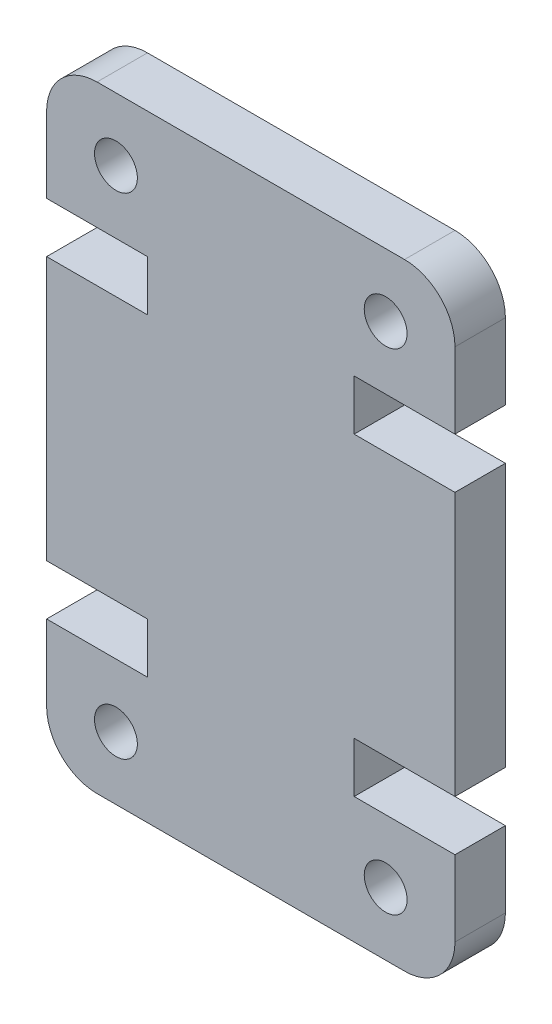
ISO-10303-21;
HEADER;
FILE_DESCRIPTION(('STEP AP214'),'2;1');
FILE_NAME('part.step','',(''),(''),'','','');
FILE_SCHEMA(('AUTOMOTIVE_DESIGN { 1 0 10303 214 1 1 1 1 }'));
ENDSEC;
DATA;
#1=APPLICATION_CONTEXT('core data for automotive mechanical design processes');
#2=APPLICATION_PROTOCOL_DEFINITION('international standard','automotive_design',2000,#1);
#3=PRODUCT_CONTEXT('',#1,'mechanical');
#4=PRODUCT('Part','Part','',(#3));
#5=PRODUCT_RELATED_PRODUCT_CATEGORY('part','',(#4));
#6=PRODUCT_DEFINITION_FORMATION('','',#4);
#7=PRODUCT_DEFINITION_CONTEXT('part definition',#1,'design');
#8=PRODUCT_DEFINITION('design','',#6,#7);
#9=PRODUCT_DEFINITION_SHAPE('','',#8);
#10=(LENGTH_UNIT() NAMED_UNIT(*) SI_UNIT(.MILLI.,.METRE.));
#11=(NAMED_UNIT(*) PLANE_ANGLE_UNIT() SI_UNIT($,.RADIAN.));
#12=(NAMED_UNIT(*) SI_UNIT($,.STERADIAN.) SOLID_ANGLE_UNIT());
#13=UNCERTAINTY_MEASURE_WITH_UNIT(LENGTH_MEASURE(1.E-05),#10,'distance_accuracy_value','');
#14=(GEOMETRIC_REPRESENTATION_CONTEXT(3) GLOBAL_UNCERTAINTY_ASSIGNED_CONTEXT((#13)) GLOBAL_UNIT_ASSIGNED_CONTEXT((#10,
#11,#12)) REPRESENTATION_CONTEXT('',''));
#15=CARTESIAN_POINT('',(0.,0.,0.));
#16=DIRECTION('',(0.,0.,1.));
#17=DIRECTION('',(1.,0.,0.));
#18=AXIS2_PLACEMENT_3D('',#15,#16,#17);
#19=CARTESIAN_POINT('',(14.2,2.,4.));
#20=DIRECTION('',(0.,0.,-1.));
#21=DIRECTION('',(-1.,0.,0.));
#22=AXIS2_PLACEMENT_3D('',#19,#20,#21);
#23=CYLINDRICAL_SURFACE('',#22,2.);
#24=CARTESIAN_POINT('',(14.2,2.,2.));
#25=DIRECTION('',(0.,0.,-1.));
#26=DIRECTION('',(-1.,0.,0.));
#27=AXIS2_PLACEMENT_3D('',#24,#25,#26);
#28=CIRCLE('',#27,2.);
#29=CARTESIAN_POINT('',(16.2,2.00000000000001,2.));
#30=VERTEX_POINT('',#29);
#31=CARTESIAN_POINT('',(14.2,0.,2.));
#32=VERTEX_POINT('',#31);
#33=EDGE_CURVE('E48',#30,#32,#28,.T.);
#34=ORIENTED_EDGE('',*,*,#33,.F.);
#35=DIRECTION('',(0.,0.,-1.));
#36=VECTOR('',#35,1.);
#37=CARTESIAN_POINT('',(16.2,2.,4.));
#38=LINE('',#37,#36);
#39=CARTESIAN_POINT('',(16.2,2.,4.));
#40=VERTEX_POINT('',#39);
#41=EDGE_CURVE('E11',#40,#30,#38,.T.);
#42=ORIENTED_EDGE('',*,*,#41,.F.);
#43=CARTESIAN_POINT('',(14.2,2.,4.));
#44=DIRECTION('',(0.,0.,1.));
#45=DIRECTION('',(-1.,0.,0.));
#46=AXIS2_PLACEMENT_3D('',#43,#44,#45);
#47=CIRCLE('',#46,2.);
#48=CARTESIAN_POINT('',(14.2,0.,4.));
#49=VERTEX_POINT('',#48);
#50=EDGE_CURVE('E353',#49,#40,#47,.T.);
#51=ORIENTED_EDGE('',*,*,#50,.F.);
#52=DIRECTION('',(0.,0.,-1.));
#53=VECTOR('',#52,1.);
#54=CARTESIAN_POINT('',(14.2,0.,4.));
#55=LINE('',#54,#53);
#56=EDGE_CURVE('E214',#49,#32,#55,.T.);
#57=ORIENTED_EDGE('',*,*,#56,.T.);
#58=EDGE_LOOP('',(#34,#42,#51,#57));
#59=FACE_BOUND('',#58,.T.);
#60=ADVANCED_FACE('F33',(#59),#23,.T.);
#61=CARTESIAN_POINT('',(16.2,5.00000000000014,4.));
#62=DIRECTION('',(-1.,0.,0.));
#63=DIRECTION('',(0.,0.,1.));
#64=AXIS2_PLACEMENT_3D('',#61,#62,#63);
#65=PLANE('',#64);
#66=DIRECTION('',(0.,-1.,0.));
#67=VECTOR('',#66,1.);
#68=CARTESIAN_POINT('',(16.2,24.45,2.));
#69=LINE('',#68,#67);
#70=CARTESIAN_POINT('',(16.2,5.00000000000014,2.));
#71=VERTEX_POINT('',#70);
#72=EDGE_CURVE('E290',#71,#30,#69,.T.);
#73=ORIENTED_EDGE('',*,*,#72,.F.);
#74=DIRECTION('',(0.,0.,-1.));
#75=VECTOR('',#74,1.);
#76=CARTESIAN_POINT('',(16.2,5.00000000000014,4.));
#77=LINE('',#76,#75);
#78=CARTESIAN_POINT('',(16.2,5.00000000000014,4.));
#79=VERTEX_POINT('',#78);
#80=EDGE_CURVE('E41',#79,#71,#77,.T.);
#81=ORIENTED_EDGE('',*,*,#80,.F.);
#82=DIRECTION('',(0.,1.,0.));
#83=VECTOR('',#82,1.);
#84=CARTESIAN_POINT('',(16.2,5.00000000000014,4.));
#85=LINE('',#84,#83);
#86=EDGE_CURVE('E289',#40,#79,#85,.T.);
#87=ORIENTED_EDGE('',*,*,#86,.F.);
#88=ORIENTED_EDGE('',*,*,#41,.T.);
#89=EDGE_LOOP('',(#73,#81,#87,#88));
#90=FACE_BOUND('',#89,.T.);
#91=ADVANCED_FACE('F288',(#90),#65,.F.);
#92=CARTESIAN_POINT('',(12.2,5.00000000000014,4.));
#93=DIRECTION('',(0.,-1.,0.));
#94=DIRECTION('',(0.,0.,-1.));
#95=AXIS2_PLACEMENT_3D('',#92,#93,#94);
#96=PLANE('',#95);
#97=DIRECTION('',(1.,0.,0.));
#98=VECTOR('',#97,1.);
#99=CARTESIAN_POINT('',(12.2,5.00000000000014,2.));
#100=LINE('',#99,#98);
#101=CARTESIAN_POINT('',(12.2,5.00000000000014,2.));
#102=VERTEX_POINT('',#101);
#103=EDGE_CURVE('E284',#102,#71,#100,.T.);
#104=ORIENTED_EDGE('',*,*,#103,.F.);
#105=DIRECTION('',(0.,0.,-1.));
#106=VECTOR('',#105,1.);
#107=CARTESIAN_POINT('',(12.2,5.00000000000014,4.));
#108=LINE('',#107,#106);
#109=CARTESIAN_POINT('',(12.2,5.00000000000014,4.));
#110=VERTEX_POINT('',#109);
#111=EDGE_CURVE('E274',#110,#102,#108,.T.);
#112=ORIENTED_EDGE('',*,*,#111,.F.);
#113=DIRECTION('',(-1.,0.,0.));
#114=VECTOR('',#113,1.);
#115=CARTESIAN_POINT('',(12.2,5.00000000000014,4.));
#116=LINE('',#115,#114);
#117=EDGE_CURVE('E285',#79,#110,#116,.T.);
#118=ORIENTED_EDGE('',*,*,#117,.F.);
#119=ORIENTED_EDGE('',*,*,#80,.T.);
#120=EDGE_LOOP('',(#104,#112,#118,#119));
#121=FACE_BOUND('',#120,.T.);
#122=ADVANCED_FACE('F282',(#121),#96,.F.);
#123=CARTESIAN_POINT('',(12.2,7.00000000000014,4.));
#124=DIRECTION('',(-1.,0.,0.));
#125=DIRECTION('',(0.,0.,1.));
#126=AXIS2_PLACEMENT_3D('',#123,#124,#125);
#127=PLANE('',#126);
#128=DIRECTION('',(0.,-1.,0.));
#129=VECTOR('',#128,1.);
#130=CARTESIAN_POINT('',(12.2,7.00000000000014,2.));
#131=LINE('',#130,#129);
#132=CARTESIAN_POINT('',(12.2,7.00000000000014,2.));
#133=VERTEX_POINT('',#132);
#134=EDGE_CURVE('E337',#133,#102,#131,.T.);
#135=ORIENTED_EDGE('',*,*,#134,.F.);
#136=DIRECTION('',(0.,0.,-1.));
#137=VECTOR('',#136,1.);
#138=CARTESIAN_POINT('',(12.2,7.00000000000014,4.));
#139=LINE('',#138,#137);
#140=CARTESIAN_POINT('',(12.2,7.00000000000014,4.));
#141=VERTEX_POINT('',#140);
#142=EDGE_CURVE('E271',#141,#133,#139,.T.);
#143=ORIENTED_EDGE('',*,*,#142,.F.);
#144=DIRECTION('',(0.,1.,0.));
#145=VECTOR('',#144,1.);
#146=CARTESIAN_POINT('',(12.2,7.00000000000014,4.));
#147=LINE('',#146,#145);
#148=EDGE_CURVE('E357',#110,#141,#147,.T.);
#149=ORIENTED_EDGE('',*,*,#148,.F.);
#150=ORIENTED_EDGE('',*,*,#111,.T.);
#151=EDGE_LOOP('',(#135,#143,#149,#150));
#152=FACE_BOUND('',#151,.T.);
#153=ADVANCED_FACE('F460',(#152),#127,.F.);
#154=CARTESIAN_POINT('',(16.2,7.00000000000014,4.));
#155=DIRECTION('',(0.,1.,0.));
#156=DIRECTION('',(-1.,0.,0.));
#157=AXIS2_PLACEMENT_3D('',#154,#155,#156);
#158=PLANE('',#157);
#159=DIRECTION('',(-1.,0.,0.));
#160=VECTOR('',#159,1.);
#161=CARTESIAN_POINT('',(16.2,7.00000000000014,2.));
#162=LINE('',#161,#160);
#163=CARTESIAN_POINT('',(16.2,7.00000000000014,2.));
#164=VERTEX_POINT('',#163);
#165=EDGE_CURVE('E335',#164,#133,#162,.T.);
#166=ORIENTED_EDGE('',*,*,#165,.F.);
#167=DIRECTION('',(0.,0.,-1.));
#168=VECTOR('',#167,1.);
#169=CARTESIAN_POINT('',(16.2,7.00000000000014,4.));
#170=LINE('',#169,#168);
#171=CARTESIAN_POINT('',(16.2,7.00000000000014,4.));
#172=VERTEX_POINT('',#171);
#173=EDGE_CURVE('E268',#172,#164,#170,.T.);
#174=ORIENTED_EDGE('',*,*,#173,.F.);
#175=DIRECTION('',(1.,0.,0.));
#176=VECTOR('',#175,1.);
#177=CARTESIAN_POINT('',(16.2,7.00000000000014,4.));
#178=LINE('',#177,#176);
#179=EDGE_CURVE('E359',#141,#172,#178,.T.);
#180=ORIENTED_EDGE('',*,*,#179,.F.);
#181=ORIENTED_EDGE('',*,*,#142,.T.);
#182=EDGE_LOOP('',(#166,#174,#180,#181));
#183=FACE_BOUND('',#182,.T.);
#184=ADVANCED_FACE('F456',(#183),#158,.F.);
#185=CARTESIAN_POINT('',(16.2,17.4499999999999,4.));
#186=DIRECTION('',(-1.,0.,0.));
#187=DIRECTION('',(0.,0.,1.));
#188=AXIS2_PLACEMENT_3D('',#185,#186,#187);
#189=PLANE('',#188);
#190=CARTESIAN_POINT('',(16.2,17.4499999999999,2.));
#191=VERTEX_POINT('',#190);
#192=EDGE_CURVE('E292',#191,#164,#69,.T.);
#193=ORIENTED_EDGE('',*,*,#192,.F.);
#194=DIRECTION('',(0.,0.,-1.));
#195=VECTOR('',#194,1.);
#196=CARTESIAN_POINT('',(16.2,17.4499999999999,4.));
#197=LINE('',#196,#195);
#198=CARTESIAN_POINT('',(16.2,17.4499999999999,4.));
#199=VERTEX_POINT('',#198);
#200=EDGE_CURVE('E265',#199,#191,#197,.T.);
#201=ORIENTED_EDGE('',*,*,#200,.F.);
#202=DIRECTION('',(0.,1.,0.));
#203=VECTOR('',#202,1.);
#204=CARTESIAN_POINT('',(16.2,17.4499999999999,4.));
#205=LINE('',#204,#203);
#206=EDGE_CURVE('E361',#172,#199,#205,.T.);
#207=ORIENTED_EDGE('',*,*,#206,.F.);
#208=ORIENTED_EDGE('',*,*,#173,.T.);
#209=EDGE_LOOP('',(#193,#201,#207,#208));
#210=FACE_BOUND('',#209,.T.);
#211=ADVANCED_FACE('F451',(#210),#189,.F.);
#212=CARTESIAN_POINT('',(16.2,17.4499999999999,4.));
#213=DIRECTION('',(0.,-1.,0.));
#214=DIRECTION('',(1.,0.,0.));
#215=AXIS2_PLACEMENT_3D('',#212,#213,#214);
#216=PLANE('',#215);
#217=DIRECTION('',(1.,0.,0.));
#218=VECTOR('',#217,1.);
#219=CARTESIAN_POINT('',(16.2,17.4499999999999,2.));
#220=LINE('',#219,#218);
#221=CARTESIAN_POINT('',(12.2,17.4499999999999,2.));
#222=VERTEX_POINT('',#221);
#223=EDGE_CURVE('E333',#222,#191,#220,.T.);
#224=ORIENTED_EDGE('',*,*,#223,.F.);
#225=DIRECTION('',(0.,0.,-1.));
#226=VECTOR('',#225,1.);
#227=CARTESIAN_POINT('',(12.2,17.4499999999999,4.));
#228=LINE('',#227,#226);
#229=CARTESIAN_POINT('',(12.2,17.4499999999999,4.));
#230=VERTEX_POINT('',#229);
#231=EDGE_CURVE('E262',#230,#222,#228,.T.);
#232=ORIENTED_EDGE('',*,*,#231,.F.);
#233=DIRECTION('',(-1.,0.,0.));
#234=VECTOR('',#233,1.);
#235=CARTESIAN_POINT('',(16.2,17.4499999999999,4.));
#236=LINE('',#235,#234);
#237=EDGE_CURVE('E363',#199,#230,#236,.T.);
#238=ORIENTED_EDGE('',*,*,#237,.F.);
#239=ORIENTED_EDGE('',*,*,#200,.T.);
#240=EDGE_LOOP('',(#224,#232,#238,#239));
#241=FACE_BOUND('',#240,.T.);
#242=ADVANCED_FACE('F446',(#241),#216,.F.);
#243=CARTESIAN_POINT('',(12.2,17.4499999999999,4.));
#244=DIRECTION('',(-1.,0.,0.));
#245=DIRECTION('',(0.,0.,1.));
#246=AXIS2_PLACEMENT_3D('',#243,#244,#245);
#247=PLANE('',#246);
#248=DIRECTION('',(0.,-1.,0.));
#249=VECTOR('',#248,1.);
#250=CARTESIAN_POINT('',(12.2,17.4499999999999,2.));
#251=LINE('',#250,#249);
#252=CARTESIAN_POINT('',(12.2,19.4499999999999,2.));
#253=VERTEX_POINT('',#252);
#254=EDGE_CURVE('E331',#253,#222,#251,.T.);
#255=ORIENTED_EDGE('',*,*,#254,.F.);
#256=DIRECTION('',(0.,0.,-1.));
#257=VECTOR('',#256,1.);
#258=CARTESIAN_POINT('',(12.2,19.4499999999999,4.));
#259=LINE('',#258,#257);
#260=CARTESIAN_POINT('',(12.2,19.4499999999999,4.));
#261=VERTEX_POINT('',#260);
#262=EDGE_CURVE('E259',#261,#253,#259,.T.);
#263=ORIENTED_EDGE('',*,*,#262,.F.);
#264=DIRECTION('',(0.,1.,0.));
#265=VECTOR('',#264,1.);
#266=CARTESIAN_POINT('',(12.2,17.4499999999999,4.));
#267=LINE('',#266,#265);
#268=EDGE_CURVE('E365',#230,#261,#267,.T.);
#269=ORIENTED_EDGE('',*,*,#268,.F.);
#270=ORIENTED_EDGE('',*,*,#231,.T.);
#271=EDGE_LOOP('',(#255,#263,#269,#270));
#272=FACE_BOUND('',#271,.T.);
#273=ADVANCED_FACE('F441',(#272),#247,.F.);
#274=CARTESIAN_POINT('',(12.2,19.4499999999999,4.));
#275=DIRECTION('',(0.,1.,0.));
#276=DIRECTION('',(0.,0.,1.));
#277=AXIS2_PLACEMENT_3D('',#274,#275,#276);
#278=PLANE('',#277);
#279=DIRECTION('',(-1.,0.,0.));
#280=VECTOR('',#279,1.);
#281=CARTESIAN_POINT('',(12.2,19.4499999999999,2.));
#282=LINE('',#281,#280);
#283=CARTESIAN_POINT('',(16.2,19.4499999999999,2.));
#284=VERTEX_POINT('',#283);
#285=EDGE_CURVE('E329',#284,#253,#282,.T.);
#286=ORIENTED_EDGE('',*,*,#285,.F.);
#287=DIRECTION('',(0.,0.,-1.));
#288=VECTOR('',#287,1.);
#289=CARTESIAN_POINT('',(16.2,19.4499999999999,4.));
#290=LINE('',#289,#288);
#291=CARTESIAN_POINT('',(16.2,19.4499999999999,4.));
#292=VERTEX_POINT('',#291);
#293=EDGE_CURVE('E256',#292,#284,#290,.T.);
#294=ORIENTED_EDGE('',*,*,#293,.F.);
#295=DIRECTION('',(1.,0.,0.));
#296=VECTOR('',#295,1.);
#297=CARTESIAN_POINT('',(12.2,19.4499999999999,4.));
#298=LINE('',#297,#296);
#299=EDGE_CURVE('E367',#261,#292,#298,.T.);
#300=ORIENTED_EDGE('',*,*,#299,.F.);
#301=ORIENTED_EDGE('',*,*,#262,.T.);
#302=EDGE_LOOP('',(#286,#294,#300,#301));
#303=FACE_BOUND('',#302,.T.);
#304=ADVANCED_FACE('F436',(#303),#278,.F.);
#305=CARTESIAN_POINT('',(16.2,19.4499999999999,4.));
#306=DIRECTION('',(-1.,0.,0.));
#307=DIRECTION('',(0.,0.,1.));
#308=AXIS2_PLACEMENT_3D('',#305,#306,#307);
#309=PLANE('',#308);
#310=CARTESIAN_POINT('',(16.2,22.45,2.));
#311=VERTEX_POINT('',#310);
#312=EDGE_CURVE('E295',#311,#284,#69,.T.);
#313=ORIENTED_EDGE('',*,*,#312,.F.);
#314=DIRECTION('',(0.,0.,-1.));
#315=VECTOR('',#314,1.);
#316=CARTESIAN_POINT('',(16.2,22.45,4.));
#317=LINE('',#316,#315);
#318=CARTESIAN_POINT('',(16.2,22.45,4.));
#319=VERTEX_POINT('',#318);
#320=EDGE_CURVE('E253',#319,#311,#317,.T.);
#321=ORIENTED_EDGE('',*,*,#320,.F.);
#322=DIRECTION('',(0.,1.,0.));
#323=VECTOR('',#322,1.);
#324=CARTESIAN_POINT('',(16.2,19.4499999999999,4.));
#325=LINE('',#324,#323);
#326=EDGE_CURVE('E369',#292,#319,#325,.T.);
#327=ORIENTED_EDGE('',*,*,#326,.F.);
#328=ORIENTED_EDGE('',*,*,#293,.T.);
#329=EDGE_LOOP('',(#313,#321,#327,#328));
#330=FACE_BOUND('',#329,.T.);
#331=ADVANCED_FACE('F432',(#330),#309,.F.);
#332=CARTESIAN_POINT('',(14.2,22.45,4.));
#333=DIRECTION('',(0.,0.,-1.));
#334=DIRECTION('',(-1.,0.,0.));
#335=AXIS2_PLACEMENT_3D('',#332,#333,#334);
#336=CYLINDRICAL_SURFACE('',#335,2.);
#337=CARTESIAN_POINT('',(14.2,22.45,2.));
#338=DIRECTION('',(0.,0.,-1.));
#339=DIRECTION('',(-1.,0.,0.));
#340=AXIS2_PLACEMENT_3D('',#337,#338,#339);
#341=CIRCLE('',#340,2.);
#342=CARTESIAN_POINT('',(14.2,24.45,2.));
#343=VERTEX_POINT('',#342);
#344=EDGE_CURVE('E327',#343,#311,#341,.T.);
#345=ORIENTED_EDGE('',*,*,#344,.F.);
#346=DIRECTION('',(0.,0.,-1.));
#347=VECTOR('',#346,1.);
#348=CARTESIAN_POINT('',(14.2,24.45,4.));
#349=LINE('',#348,#347);
#350=CARTESIAN_POINT('',(14.2,24.45,4.));
#351=VERTEX_POINT('',#350);
#352=EDGE_CURVE('E250',#351,#343,#349,.T.);
#353=ORIENTED_EDGE('',*,*,#352,.F.);
#354=CARTESIAN_POINT('',(14.2,22.45,4.));
#355=DIRECTION('',(0.,0.,1.));
#356=DIRECTION('',(1.,0.,0.));
#357=AXIS2_PLACEMENT_3D('',#354,#355,#356);
#358=CIRCLE('',#357,2.);
#359=EDGE_CURVE('E371',#319,#351,#358,.T.);
#360=ORIENTED_EDGE('',*,*,#359,.F.);
#361=ORIENTED_EDGE('',*,*,#320,.T.);
#362=EDGE_LOOP('',(#345,#353,#360,#361));
#363=FACE_BOUND('',#362,.T.);
#364=ADVANCED_FACE('F428',(#363),#336,.T.);
#365=CARTESIAN_POINT('',(1.99999999999999,24.45,4.));
#366=DIRECTION('',(0.,-1.,0.));
#367=DIRECTION('',(0.,0.,-1.));
#368=AXIS2_PLACEMENT_3D('',#365,#366,#367);
#369=PLANE('',#368);
#370=DIRECTION('',(1.,0.,0.));
#371=VECTOR('',#370,1.);
#372=CARTESIAN_POINT('',(0.,24.45,2.));
#373=LINE('',#372,#371);
#374=CARTESIAN_POINT('',(2.,24.45,2.));
#375=VERTEX_POINT('',#374);
#376=EDGE_CURVE('E293',#375,#343,#373,.T.);
#377=ORIENTED_EDGE('',*,*,#376,.F.);
#378=DIRECTION('',(0.,0.,-1.));
#379=VECTOR('',#378,1.);
#380=CARTESIAN_POINT('',(1.99999999999999,24.45,4.));
#381=LINE('',#380,#379);
#382=CARTESIAN_POINT('',(1.99999999999999,24.45,4.));
#383=VERTEX_POINT('',#382);
#384=EDGE_CURVE('E247',#383,#375,#381,.T.);
#385=ORIENTED_EDGE('',*,*,#384,.F.);
#386=DIRECTION('',(-1.,0.,0.));
#387=VECTOR('',#386,1.);
#388=CARTESIAN_POINT('',(1.99999999999999,24.45,4.));
#389=LINE('',#388,#387);
#390=EDGE_CURVE('E373',#351,#383,#389,.T.);
#391=ORIENTED_EDGE('',*,*,#390,.F.);
#392=ORIENTED_EDGE('',*,*,#352,.T.);
#393=EDGE_LOOP('',(#377,#385,#391,#392));
#394=FACE_BOUND('',#393,.T.);
#395=ADVANCED_FACE('F425',(#394),#369,.F.);
#396=CARTESIAN_POINT('',(2.,22.45,4.));
#397=DIRECTION('',(0.,0.,-1.));
#398=DIRECTION('',(-1.,0.,0.));
#399=AXIS2_PLACEMENT_3D('',#396,#397,#398);
#400=CYLINDRICAL_SURFACE('',#399,2.);
#401=CARTESIAN_POINT('',(2.,22.45,2.));
#402=DIRECTION('',(0.,0.,-1.));
#403=DIRECTION('',(-1.,0.,0.));
#404=AXIS2_PLACEMENT_3D('',#401,#402,#403);
#405=CIRCLE('',#404,2.);
#406=CARTESIAN_POINT('',(0.,22.45,2.));
#407=VERTEX_POINT('',#406);
#408=EDGE_CURVE('E325',#407,#375,#405,.T.);
#409=ORIENTED_EDGE('',*,*,#408,.F.);
#410=DIRECTION('',(0.,0.,-1.));
#411=VECTOR('',#410,1.);
#412=CARTESIAN_POINT('',(0.,22.45,4.));
#413=LINE('',#412,#411);
#414=CARTESIAN_POINT('',(0.,22.45,4.));
#415=VERTEX_POINT('',#414);
#416=EDGE_CURVE('E244',#415,#407,#413,.T.);
#417=ORIENTED_EDGE('',*,*,#416,.F.);
#418=CARTESIAN_POINT('',(2.,22.45,4.));
#419=DIRECTION('',(0.,0.,1.));
#420=DIRECTION('',(-1.,0.,0.));
#421=AXIS2_PLACEMENT_3D('',#418,#419,#420);
#422=CIRCLE('',#421,2.);
#423=EDGE_CURVE('E375',#383,#415,#422,.T.);
#424=ORIENTED_EDGE('',*,*,#423,.F.);
#425=ORIENTED_EDGE('',*,*,#384,.T.);
#426=EDGE_LOOP('',(#409,#417,#424,#425));
#427=FACE_BOUND('',#426,.T.);
#428=ADVANCED_FACE('F414',(#427),#400,.T.);
#429=CARTESIAN_POINT('',(0.,19.4499999999999,4.));
#430=DIRECTION('',(1.,0.,0.));
#431=DIRECTION('',(0.,1.,0.));
#432=AXIS2_PLACEMENT_3D('',#429,#430,#431);
#433=PLANE('',#432);
#434=DIRECTION('',(0.,1.,0.));
#435=VECTOR('',#434,1.);
#436=CARTESIAN_POINT('',(0.,0.,2.));
#437=LINE('',#436,#435);
#438=CARTESIAN_POINT('',(0.,19.4499999999999,2.));
#439=VERTEX_POINT('',#438);
#440=EDGE_CURVE('E200',#439,#407,#437,.T.);
#441=ORIENTED_EDGE('',*,*,#440,.F.);
#442=DIRECTION('',(0.,0.,-1.));
#443=VECTOR('',#442,1.);
#444=CARTESIAN_POINT('',(0.,19.4499999999999,4.));
#445=LINE('',#444,#443);
#446=CARTESIAN_POINT('',(0.,19.4499999999999,4.));
#447=VERTEX_POINT('',#446);
#448=EDGE_CURVE('E241',#447,#439,#445,.T.);
#449=ORIENTED_EDGE('',*,*,#448,.F.);
#450=DIRECTION('',(0.,-1.,0.));
#451=VECTOR('',#450,1.);
#452=CARTESIAN_POINT('',(0.,19.4499999999999,4.));
#453=LINE('',#452,#451);
#454=EDGE_CURVE('E377',#415,#447,#453,.T.);
#455=ORIENTED_EDGE('',*,*,#454,.F.);
#456=ORIENTED_EDGE('',*,*,#416,.T.);
#457=EDGE_LOOP('',(#441,#449,#455,#456));
#458=FACE_BOUND('',#457,.T.);
#459=ADVANCED_FACE('F418',(#458),#433,.F.);
#460=CARTESIAN_POINT('',(3.99999999999999,19.4499999999999,4.));
#461=DIRECTION('',(0.,1.,0.));
#462=DIRECTION('',(-1.,0.,0.));
#463=AXIS2_PLACEMENT_3D('',#460,#461,#462);
#464=PLANE('',#463);
#465=DIRECTION('',(-1.,0.,0.));
#466=VECTOR('',#465,1.);
#467=CARTESIAN_POINT('',(3.99999999999999,19.4499999999999,2.));
#468=LINE('',#467,#466);
#469=CARTESIAN_POINT('',(3.99999999999999,19.4499999999999,2.));
#470=VERTEX_POINT('',#469);
#471=EDGE_CURVE('E323',#470,#439,#468,.T.);
#472=ORIENTED_EDGE('',*,*,#471,.F.);
#473=DIRECTION('',(0.,0.,-1.));
#474=VECTOR('',#473,1.);
#475=CARTESIAN_POINT('',(3.99999999999999,19.4499999999999,4.));
#476=LINE('',#475,#474);
#477=CARTESIAN_POINT('',(3.99999999999999,19.4499999999999,4.));
#478=VERTEX_POINT('',#477);
#479=EDGE_CURVE('E238',#478,#470,#476,.T.);
#480=ORIENTED_EDGE('',*,*,#479,.F.);
#481=DIRECTION('',(1.,0.,0.));
#482=VECTOR('',#481,1.);
#483=CARTESIAN_POINT('',(3.99999999999999,19.4499999999999,4.));
#484=LINE('',#483,#482);
#485=EDGE_CURVE('E379',#447,#478,#484,.T.);
#486=ORIENTED_EDGE('',*,*,#485,.F.);
#487=ORIENTED_EDGE('',*,*,#448,.T.);
#488=EDGE_LOOP('',(#472,#480,#486,#487));
#489=FACE_BOUND('',#488,.T.);
#490=ADVANCED_FACE('F495',(#489),#464,.F.);
#491=CARTESIAN_POINT('',(3.99999999999999,17.4499999999999,4.));
#492=DIRECTION('',(1.,0.,0.));
#493=DIRECTION('',(0.,0.,-1.));
#494=AXIS2_PLACEMENT_3D('',#491,#492,#493);
#495=PLANE('',#494);
#496=DIRECTION('',(0.,1.,0.));
#497=VECTOR('',#496,1.);
#498=CARTESIAN_POINT('',(3.99999999999999,17.4499999999999,2.));
#499=LINE('',#498,#497);
#500=CARTESIAN_POINT('',(3.99999999999999,17.4499999999999,2.));
#501=VERTEX_POINT('',#500);
#502=EDGE_CURVE('E321',#501,#470,#499,.T.);
#503=ORIENTED_EDGE('',*,*,#502,.F.);
#504=DIRECTION('',(0.,0.,-1.));
#505=VECTOR('',#504,1.);
#506=CARTESIAN_POINT('',(3.99999999999999,17.4499999999999,4.));
#507=LINE('',#506,#505);
#508=CARTESIAN_POINT('',(3.99999999999999,17.4499999999999,4.));
#509=VERTEX_POINT('',#508);
#510=EDGE_CURVE('E235',#509,#501,#507,.T.);
#511=ORIENTED_EDGE('',*,*,#510,.F.);
#512=DIRECTION('',(0.,-1.,0.));
#513=VECTOR('',#512,1.);
#514=CARTESIAN_POINT('',(3.99999999999999,17.4499999999999,4.));
#515=LINE('',#514,#513);
#516=EDGE_CURVE('E381',#478,#509,#515,.T.);
#517=ORIENTED_EDGE('',*,*,#516,.F.);
#518=ORIENTED_EDGE('',*,*,#479,.T.);
#519=EDGE_LOOP('',(#503,#511,#517,#518));
#520=FACE_BOUND('',#519,.T.);
#521=ADVANCED_FACE('F498',(#520),#495,.F.);
#522=CARTESIAN_POINT('',(0.,17.4499999999999,4.));
#523=DIRECTION('',(0.,-1.,0.));
#524=DIRECTION('',(1.,0.,0.));
#525=AXIS2_PLACEMENT_3D('',#522,#523,#524);
#526=PLANE('',#525);
#527=DIRECTION('',(1.,0.,0.));
#528=VECTOR('',#527,1.);
#529=CARTESIAN_POINT('',(0.,17.4499999999999,2.));
#530=LINE('',#529,#528);
#531=CARTESIAN_POINT('',(0.,17.4499999999999,2.));
#532=VERTEX_POINT('',#531);
#533=EDGE_CURVE('E319',#532,#501,#530,.T.);
#534=ORIENTED_EDGE('',*,*,#533,.F.);
#535=DIRECTION('',(0.,0.,-1.));
#536=VECTOR('',#535,1.);
#537=CARTESIAN_POINT('',(0.,17.4499999999999,4.));
#538=LINE('',#537,#536);
#539=CARTESIAN_POINT('',(0.,17.4499999999999,4.));
#540=VERTEX_POINT('',#539);
#541=EDGE_CURVE('E232',#540,#532,#538,.T.);
#542=ORIENTED_EDGE('',*,*,#541,.F.);
#543=DIRECTION('',(-1.,0.,0.));
#544=VECTOR('',#543,1.);
#545=CARTESIAN_POINT('',(0.,17.4499999999999,4.));
#546=LINE('',#545,#544);
#547=EDGE_CURVE('E383',#509,#540,#546,.T.);
#548=ORIENTED_EDGE('',*,*,#547,.F.);
#549=ORIENTED_EDGE('',*,*,#510,.T.);
#550=EDGE_LOOP('',(#534,#542,#548,#549));
#551=FACE_BOUND('',#550,.T.);
#552=ADVANCED_FACE('F502',(#551),#526,.F.);
#553=CARTESIAN_POINT('',(0.,17.4499999999999,4.));
#554=DIRECTION('',(1.,0.,0.));
#555=DIRECTION('',(0.,0.,-1.));
#556=AXIS2_PLACEMENT_3D('',#553,#554,#555);
#557=PLANE('',#556);
#558=CARTESIAN_POINT('',(0.,7.00000000000013,2.));
#559=VERTEX_POINT('',#558);
#560=EDGE_CURVE('E404',#559,#532,#437,.T.);
#561=ORIENTED_EDGE('',*,*,#560,.F.);
#562=DIRECTION('',(0.,0.,-1.));
#563=VECTOR('',#562,1.);
#564=CARTESIAN_POINT('',(0.,7.00000000000012,4.));
#565=LINE('',#564,#563);
#566=CARTESIAN_POINT('',(0.,7.00000000000012,4.));
#567=VERTEX_POINT('',#566);
#568=EDGE_CURVE('E229',#567,#559,#565,.T.);
#569=ORIENTED_EDGE('',*,*,#568,.F.);
#570=DIRECTION('',(0.,-1.,0.));
#571=VECTOR('',#570,1.);
#572=CARTESIAN_POINT('',(0.,17.4499999999999,4.));
#573=LINE('',#572,#571);
#574=EDGE_CURVE('E385',#540,#567,#573,.T.);
#575=ORIENTED_EDGE('',*,*,#574,.F.);
#576=ORIENTED_EDGE('',*,*,#541,.T.);
#577=EDGE_LOOP('',(#561,#569,#575,#576));
#578=FACE_BOUND('',#577,.T.);
#579=ADVANCED_FACE('F506',(#578),#557,.F.);
#580=CARTESIAN_POINT('',(0.,7.00000000000012,4.));
#581=DIRECTION('',(0.,1.,0.));
#582=DIRECTION('',(-1.,0.,0.));
#583=AXIS2_PLACEMENT_3D('',#580,#581,#582);
#584=PLANE('',#583);
#585=DIRECTION('',(-1.,0.,0.));
#586=VECTOR('',#585,1.);
#587=CARTESIAN_POINT('',(0.,7.00000000000012,2.));
#588=LINE('',#587,#586);
#589=CARTESIAN_POINT('',(4.,7.00000000000014,2.));
#590=VERTEX_POINT('',#589);
#591=EDGE_CURVE('E317',#590,#559,#588,.T.);
#592=ORIENTED_EDGE('',*,*,#591,.F.);
#593=DIRECTION('',(0.,0.,-1.));
#594=VECTOR('',#593,1.);
#595=CARTESIAN_POINT('',(4.,7.00000000000014,4.));
#596=LINE('',#595,#594);
#597=CARTESIAN_POINT('',(4.,7.00000000000014,4.));
#598=VERTEX_POINT('',#597);
#599=EDGE_CURVE('E226',#598,#590,#596,.T.);
#600=ORIENTED_EDGE('',*,*,#599,.F.);
#601=DIRECTION('',(1.,0.,0.));
#602=VECTOR('',#601,1.);
#603=CARTESIAN_POINT('',(0.,7.00000000000012,4.));
#604=LINE('',#603,#602);
#605=EDGE_CURVE('E387',#567,#598,#604,.T.);
#606=ORIENTED_EDGE('',*,*,#605,.F.);
#607=ORIENTED_EDGE('',*,*,#568,.T.);
#608=EDGE_LOOP('',(#592,#600,#606,#607));
#609=FACE_BOUND('',#608,.T.);
#610=ADVANCED_FACE('F510',(#609),#584,.F.);
#611=CARTESIAN_POINT('',(4.,7.00000000000014,4.));
#612=DIRECTION('',(1.,0.,0.));
#613=DIRECTION('',(0.,0.,-1.));
#614=AXIS2_PLACEMENT_3D('',#611,#612,#613);
#615=PLANE('',#614);
#616=DIRECTION('',(0.,1.,0.));
#617=VECTOR('',#616,1.);
#618=CARTESIAN_POINT('',(4.,7.00000000000014,2.));
#619=LINE('',#618,#617);
#620=CARTESIAN_POINT('',(4.,5.00000000000014,2.));
#621=VERTEX_POINT('',#620);
#622=EDGE_CURVE('E315',#621,#590,#619,.T.);
#623=ORIENTED_EDGE('',*,*,#622,.F.);
#624=DIRECTION('',(0.,0.,-1.));
#625=VECTOR('',#624,1.);
#626=CARTESIAN_POINT('',(4.,5.00000000000014,4.));
#627=LINE('',#626,#625);
#628=CARTESIAN_POINT('',(4.,5.00000000000014,4.));
#629=VERTEX_POINT('',#628);
#630=EDGE_CURVE('E223',#629,#621,#627,.T.);
#631=ORIENTED_EDGE('',*,*,#630,.F.);
#632=DIRECTION('',(0.,-1.,0.));
#633=VECTOR('',#632,1.);
#634=CARTESIAN_POINT('',(4.,7.00000000000014,4.));
#635=LINE('',#634,#633);
#636=EDGE_CURVE('E389',#598,#629,#635,.T.);
#637=ORIENTED_EDGE('',*,*,#636,.F.);
#638=ORIENTED_EDGE('',*,*,#599,.T.);
#639=EDGE_LOOP('',(#623,#631,#637,#638));
#640=FACE_BOUND('',#639,.T.);
#641=ADVANCED_FACE('F514',(#640),#615,.F.);
#642=CARTESIAN_POINT('',(4.,5.00000000000014,4.));
#643=DIRECTION('',(0.,-1.,0.));
#644=DIRECTION('',(1.,0.,0.));
#645=AXIS2_PLACEMENT_3D('',#642,#643,#644);
#646=PLANE('',#645);
#647=DIRECTION('',(1.,0.,0.));
#648=VECTOR('',#647,1.);
#649=CARTESIAN_POINT('',(4.,5.00000000000014,2.));
#650=LINE('',#649,#648);
#651=CARTESIAN_POINT('',(0.,5.00000000000014,2.));
#652=VERTEX_POINT('',#651);
#653=EDGE_CURVE('E210',#652,#621,#650,.T.);
#654=ORIENTED_EDGE('',*,*,#653,.F.);
#655=DIRECTION('',(0.,0.,-1.));
#656=VECTOR('',#655,1.);
#657=CARTESIAN_POINT('',(0.,5.00000000000014,4.));
#658=LINE('',#657,#656);
#659=CARTESIAN_POINT('',(0.,5.00000000000014,4.));
#660=VERTEX_POINT('',#659);
#661=EDGE_CURVE('E216',#660,#652,#658,.T.);
#662=ORIENTED_EDGE('',*,*,#661,.F.);
#663=DIRECTION('',(-1.,0.,0.));
#664=VECTOR('',#663,1.);
#665=CARTESIAN_POINT('',(4.,5.00000000000014,4.));
#666=LINE('',#665,#664);
#667=EDGE_CURVE('E391',#629,#660,#666,.T.);
#668=ORIENTED_EDGE('',*,*,#667,.F.);
#669=ORIENTED_EDGE('',*,*,#630,.T.);
#670=EDGE_LOOP('',(#654,#662,#668,#669));
#671=FACE_BOUND('',#670,.T.);
#672=ADVANCED_FACE('F518',(#671),#646,.F.);
#673=CARTESIAN_POINT('',(0.,5.00000000000014,4.));
#674=DIRECTION('',(1.,0.,0.));
#675=DIRECTION('',(0.,0.,-1.));
#676=AXIS2_PLACEMENT_3D('',#673,#674,#675);
#677=PLANE('',#676);
#678=CARTESIAN_POINT('',(0.,2.,2.));
#679=VERTEX_POINT('',#678);
#680=EDGE_CURVE('E296',#679,#652,#437,.T.);
#681=ORIENTED_EDGE('',*,*,#680,.F.);
#682=DIRECTION('',(0.,0.,-1.));
#683=VECTOR('',#682,1.);
#684=CARTESIAN_POINT('',(0.,2.00000000000002,4.));
#685=LINE('',#684,#683);
#686=CARTESIAN_POINT('',(0.,2.00000000000002,4.));
#687=VERTEX_POINT('',#686);
#688=EDGE_CURVE('E209',#687,#679,#685,.T.);
#689=ORIENTED_EDGE('',*,*,#688,.F.);
#690=DIRECTION('',(0.,-1.,0.));
#691=VECTOR('',#690,1.);
#692=CARTESIAN_POINT('',(0.,5.00000000000014,4.));
#693=LINE('',#692,#691);
#694=EDGE_CURVE('E393',#660,#687,#693,.T.);
#695=ORIENTED_EDGE('',*,*,#694,.F.);
#696=ORIENTED_EDGE('',*,*,#661,.T.);
#697=EDGE_LOOP('',(#681,#689,#695,#696));
#698=FACE_BOUND('',#697,.T.);
#699=ADVANCED_FACE('F402',(#698),#677,.F.);
#700=CARTESIAN_POINT('',(2.,2.,4.));
#701=DIRECTION('',(0.,0.,-1.));
#702=DIRECTION('',(-1.,0.,0.));
#703=AXIS2_PLACEMENT_3D('',#700,#701,#702);
#704=CYLINDRICAL_SURFACE('',#703,2.);
#705=CARTESIAN_POINT('',(2.,2.,2.));
#706=DIRECTION('',(0.,0.,-1.));
#707=DIRECTION('',(-1.,0.,0.));
#708=AXIS2_PLACEMENT_3D('',#705,#706,#707);
#709=CIRCLE('',#708,2.);
#710=CARTESIAN_POINT('',(2.,0.,2.));
#711=VERTEX_POINT('',#710);
#712=EDGE_CURVE('E195',#711,#679,#709,.T.);
#713=ORIENTED_EDGE('',*,*,#712,.F.);
#714=DIRECTION('',(0.,0.,-1.));
#715=VECTOR('',#714,1.);
#716=CARTESIAN_POINT('',(2.,0.,4.));
#717=LINE('',#716,#715);
#718=CARTESIAN_POINT('',(2.,0.,4.));
#719=VERTEX_POINT('',#718);
#720=EDGE_CURVE('E207',#719,#711,#717,.T.);
#721=ORIENTED_EDGE('',*,*,#720,.F.);
#722=CARTESIAN_POINT('',(2.,2.,4.));
#723=DIRECTION('',(0.,0.,1.));
#724=DIRECTION('',(1.,0.,0.));
#725=AXIS2_PLACEMENT_3D('',#722,#723,#724);
#726=CIRCLE('',#725,2.);
#727=EDGE_CURVE('E395',#687,#719,#726,.T.);
#728=ORIENTED_EDGE('',*,*,#727,.F.);
#729=ORIENTED_EDGE('',*,*,#688,.T.);
#730=EDGE_LOOP('',(#713,#721,#728,#729));
#731=FACE_BOUND('',#730,.T.);
#732=ADVANCED_FACE('F205',(#731),#704,.T.);
#733=CARTESIAN_POINT('',(2.,0.,4.));
#734=DIRECTION('',(0.,1.,0.));
#735=DIRECTION('',(-1.,0.,0.));
#736=AXIS2_PLACEMENT_3D('',#733,#734,#735);
#737=PLANE('',#736);
#738=DIRECTION('',(-1.,0.,0.));
#739=VECTOR('',#738,1.);
#740=CARTESIAN_POINT('',(16.2,0.,2.));
#741=LINE('',#740,#739);
#742=EDGE_CURVE('E192',#32,#711,#741,.T.);
#743=ORIENTED_EDGE('',*,*,#742,.F.);
#744=ORIENTED_EDGE('',*,*,#56,.F.);
#745=DIRECTION('',(1.,0.,0.));
#746=VECTOR('',#745,1.);
#747=CARTESIAN_POINT('',(2.,0.,4.));
#748=LINE('',#747,#746);
#749=EDGE_CURVE('E56',#719,#49,#748,.T.);
#750=ORIENTED_EDGE('',*,*,#749,.F.);
#751=ORIENTED_EDGE('',*,*,#720,.T.);
#752=EDGE_LOOP('',(#743,#744,#750,#751));
#753=FACE_BOUND('',#752,.T.);
#754=ADVANCED_FACE('F213',(#753),#737,.F.);
#755=CARTESIAN_POINT('',(13.4500000000019,2.4999999999999,4.));
#756=DIRECTION('',(0.,0.,-1.));
#757=DIRECTION('',(-1.,0.,0.));
#758=AXIS2_PLACEMENT_3D('',#755,#756,#757);
#759=CYLINDRICAL_SURFACE('',#758,0.85);
#760=CARTESIAN_POINT('',(13.4500000000019,2.4999999999999,4.));
#761=DIRECTION('',(0.,0.,1.));
#762=DIRECTION('',(-1.,0.,0.));
#763=AXIS2_PLACEMENT_3D('',#760,#761,#762);
#764=CIRCLE('',#763,0.85);
#765=CARTESIAN_POINT('',(12.6000000000019,2.4999999999999,4.));
#766=VERTEX_POINT('',#765);
#767=EDGE_CURVE('E350',#766,#766,#764,.T.);
#768=ORIENTED_EDGE('',*,*,#767,.T.);
#769=EDGE_LOOP('',(#768));
#770=FACE_BOUND('',#769,.T.);
#771=CARTESIAN_POINT('',(13.4500000000019,2.4999999999999,2.));
#772=DIRECTION('',(0.,0.,-1.));
#773=DIRECTION('',(-1.,0.,0.));
#774=AXIS2_PLACEMENT_3D('',#771,#772,#773);
#775=CIRCLE('',#774,0.85);
#776=CARTESIAN_POINT('',(12.6000000000019,2.4999999999999,2.));
#777=VERTEX_POINT('',#776);
#778=EDGE_CURVE('E211',#777,#777,#775,.T.);
#779=ORIENTED_EDGE('',*,*,#778,.T.);
#780=EDGE_LOOP('',(#779));
#781=FACE_BOUND('',#780,.T.);
#782=ADVANCED_FACE('F529',(#770,#781),#759,.F.);
#783=CARTESIAN_POINT('',(2.74999999999805,2.4999999999999,4.));
#784=DIRECTION('',(0.,0.,-1.));
#785=DIRECTION('',(-1.,0.,0.));
#786=AXIS2_PLACEMENT_3D('',#783,#784,#785);
#787=CYLINDRICAL_SURFACE('',#786,0.85);
#788=CARTESIAN_POINT('',(2.74999999999805,2.4999999999999,4.));
#789=DIRECTION('',(0.,0.,1.));
#790=DIRECTION('',(1.,0.,0.));
#791=AXIS2_PLACEMENT_3D('',#788,#789,#790);
#792=CIRCLE('',#791,0.85);
#793=CARTESIAN_POINT('',(3.59999999999805,2.4999999999999,4.));
#794=VERTEX_POINT('',#793);
#795=EDGE_CURVE('E347',#794,#794,#792,.T.);
#796=ORIENTED_EDGE('',*,*,#795,.T.);
#797=EDGE_LOOP('',(#796));
#798=FACE_BOUND('',#797,.T.);
#799=CARTESIAN_POINT('',(2.74999999999805,2.4999999999999,2.));
#800=DIRECTION('',(0.,0.,-1.));
#801=DIRECTION('',(-1.,0.,0.));
#802=AXIS2_PLACEMENT_3D('',#799,#800,#801);
#803=CIRCLE('',#802,0.85);
#804=CARTESIAN_POINT('',(1.89999999999805,2.4999999999999,2.));
#805=VERTEX_POINT('',#804);
#806=EDGE_CURVE('E306',#805,#805,#803,.T.);
#807=ORIENTED_EDGE('',*,*,#806,.T.);
#808=EDGE_LOOP('',(#807));
#809=FACE_BOUND('',#808,.T.);
#810=ADVANCED_FACE('F536',(#798,#809),#787,.F.);
#811=CARTESIAN_POINT('',(2.74999999999805,21.9500000000001,4.));
#812=DIRECTION('',(0.,0.,-1.));
#813=DIRECTION('',(-1.,0.,0.));
#814=AXIS2_PLACEMENT_3D('',#811,#812,#813);
#815=CYLINDRICAL_SURFACE('',#814,0.85);
#816=CARTESIAN_POINT('',(2.74999999999805,21.9500000000001,4.));
#817=DIRECTION('',(0.,0.,1.));
#818=DIRECTION('',(-1.,0.,0.));
#819=AXIS2_PLACEMENT_3D('',#816,#817,#818);
#820=CIRCLE('',#819,0.85);
#821=CARTESIAN_POINT('',(1.89999999999805,21.9500000000001,4.));
#822=VERTEX_POINT('',#821);
#823=EDGE_CURVE('E344',#822,#822,#820,.T.);
#824=ORIENTED_EDGE('',*,*,#823,.T.);
#825=EDGE_LOOP('',(#824));
#826=FACE_BOUND('',#825,.T.);
#827=CARTESIAN_POINT('',(2.74999999999805,21.9500000000001,2.));
#828=DIRECTION('',(0.,0.,-1.));
#829=DIRECTION('',(-1.,0.,0.));
#830=AXIS2_PLACEMENT_3D('',#827,#828,#829);
#831=CIRCLE('',#830,0.85);
#832=CARTESIAN_POINT('',(1.89999999999805,21.9500000000001,2.));
#833=VERTEX_POINT('',#832);
#834=EDGE_CURVE('E302',#833,#833,#831,.T.);
#835=ORIENTED_EDGE('',*,*,#834,.T.);
#836=EDGE_LOOP('',(#835));
#837=FACE_BOUND('',#836,.T.);
#838=ADVANCED_FACE('F540',(#826,#837),#815,.F.);
#839=CARTESIAN_POINT('',(13.4500000000019,21.9500000000001,4.));
#840=DIRECTION('',(0.,0.,-1.));
#841=DIRECTION('',(-1.,0.,0.));
#842=AXIS2_PLACEMENT_3D('',#839,#840,#841);
#843=CYLINDRICAL_SURFACE('',#842,0.85);
#844=CARTESIAN_POINT('',(13.4500000000019,21.9500000000001,4.));
#845=DIRECTION('',(0.,0.,1.));
#846=DIRECTION('',(1.,0.,0.));
#847=AXIS2_PLACEMENT_3D('',#844,#845,#846);
#848=CIRCLE('',#847,0.85);
#849=CARTESIAN_POINT('',(14.3000000000019,21.9500000000001,4.));
#850=VERTEX_POINT('',#849);
#851=EDGE_CURVE('E341',#850,#850,#848,.T.);
#852=ORIENTED_EDGE('',*,*,#851,.T.);
#853=EDGE_LOOP('',(#852));
#854=FACE_BOUND('',#853,.T.);
#855=CARTESIAN_POINT('',(13.4500000000019,21.9500000000001,2.));
#856=DIRECTION('',(0.,0.,-1.));
#857=DIRECTION('',(-1.,0.,0.));
#858=AXIS2_PLACEMENT_3D('',#855,#856,#857);
#859=CIRCLE('',#858,0.85);
#860=CARTESIAN_POINT('',(12.6000000000019,21.9500000000001,2.));
#861=VERTEX_POINT('',#860);
#862=EDGE_CURVE('E36',#861,#861,#859,.T.);
#863=ORIENTED_EDGE('',*,*,#862,.T.);
#864=EDGE_LOOP('',(#863));
#865=FACE_BOUND('',#864,.T.);
#866=ADVANCED_FACE('F532',(#854,#865),#843,.F.);
#867=CARTESIAN_POINT('',(14.2,2.,4.));
#868=DIRECTION('',(0.,0.,-1.));
#869=DIRECTION('',(-1.,0.,0.));
#870=AXIS2_PLACEMENT_3D('',#867,#868,#869);
#871=PLANE('',#870);
#872=ORIENTED_EDGE('',*,*,#823,.F.);
#873=EDGE_LOOP('',(#872));
#874=FACE_BOUND('',#873,.T.);
#875=ORIENTED_EDGE('',*,*,#767,.F.);
#876=EDGE_LOOP('',(#875));
#877=FACE_BOUND('',#876,.T.);
#878=ORIENTED_EDGE('',*,*,#50,.T.);
#879=ORIENTED_EDGE('',*,*,#86,.T.);
#880=ORIENTED_EDGE('',*,*,#117,.T.);
#881=ORIENTED_EDGE('',*,*,#148,.T.);
#882=ORIENTED_EDGE('',*,*,#179,.T.);
#883=ORIENTED_EDGE('',*,*,#206,.T.);
#884=ORIENTED_EDGE('',*,*,#237,.T.);
#885=ORIENTED_EDGE('',*,*,#268,.T.);
#886=ORIENTED_EDGE('',*,*,#299,.T.);
#887=ORIENTED_EDGE('',*,*,#326,.T.);
#888=ORIENTED_EDGE('',*,*,#359,.T.);
#889=ORIENTED_EDGE('',*,*,#390,.T.);
#890=ORIENTED_EDGE('',*,*,#423,.T.);
#891=ORIENTED_EDGE('',*,*,#454,.T.);
#892=ORIENTED_EDGE('',*,*,#485,.T.);
#893=ORIENTED_EDGE('',*,*,#516,.T.);
#894=ORIENTED_EDGE('',*,*,#547,.T.);
#895=ORIENTED_EDGE('',*,*,#574,.T.);
#896=ORIENTED_EDGE('',*,*,#605,.T.);
#897=ORIENTED_EDGE('',*,*,#636,.T.);
#898=ORIENTED_EDGE('',*,*,#667,.T.);
#899=ORIENTED_EDGE('',*,*,#694,.T.);
#900=ORIENTED_EDGE('',*,*,#727,.T.);
#901=ORIENTED_EDGE('',*,*,#749,.T.);
#902=EDGE_LOOP('',(#878,#879,#880,#881,#882,#883,#884,#885,#886,#887,#888,#889,#890,#891,#892,
#893,#894,#895,#896,#897,#898,#899,#900,#901));
#903=FACE_BOUND('',#902,.T.);
#904=ORIENTED_EDGE('',*,*,#795,.F.);
#905=EDGE_LOOP('',(#904));
#906=FACE_BOUND('',#905,.T.);
#907=ORIENTED_EDGE('',*,*,#851,.F.);
#908=EDGE_LOOP('',(#907));
#909=FACE_BOUND('',#908,.T.);
#910=ADVANCED_FACE('F396',(#874,#877,#903,#906,#909),#871,.F.);
#911=CARTESIAN_POINT('',(0.,0.,2.));
#912=DIRECTION('',(0.,0.,-1.));
#913=DIRECTION('',(-1.,0.,0.));
#914=AXIS2_PLACEMENT_3D('',#911,#912,#913);
#915=PLANE('',#914);
#916=ORIENTED_EDGE('',*,*,#778,.F.);
#917=EDGE_LOOP('',(#916));
#918=FACE_BOUND('',#917,.T.);
#919=ORIENTED_EDGE('',*,*,#806,.F.);
#920=EDGE_LOOP('',(#919));
#921=FACE_BOUND('',#920,.T.);
#922=ORIENTED_EDGE('',*,*,#834,.F.);
#923=EDGE_LOOP('',(#922));
#924=FACE_BOUND('',#923,.T.);
#925=ORIENTED_EDGE('',*,*,#862,.F.);
#926=EDGE_LOOP('',(#925));
#927=FACE_BOUND('',#926,.T.);
#928=ORIENTED_EDGE('',*,*,#33,.T.);
#929=ORIENTED_EDGE('',*,*,#742,.T.);
#930=ORIENTED_EDGE('',*,*,#712,.T.);
#931=ORIENTED_EDGE('',*,*,#680,.T.);
#932=ORIENTED_EDGE('',*,*,#653,.T.);
#933=ORIENTED_EDGE('',*,*,#622,.T.);
#934=ORIENTED_EDGE('',*,*,#591,.T.);
#935=ORIENTED_EDGE('',*,*,#560,.T.);
#936=ORIENTED_EDGE('',*,*,#533,.T.);
#937=ORIENTED_EDGE('',*,*,#502,.T.);
#938=ORIENTED_EDGE('',*,*,#471,.T.);
#939=ORIENTED_EDGE('',*,*,#440,.T.);
#940=ORIENTED_EDGE('',*,*,#408,.T.);
#941=ORIENTED_EDGE('',*,*,#376,.T.);
#942=ORIENTED_EDGE('',*,*,#344,.T.);
#943=ORIENTED_EDGE('',*,*,#312,.T.);
#944=ORIENTED_EDGE('',*,*,#285,.T.);
#945=ORIENTED_EDGE('',*,*,#254,.T.);
#946=ORIENTED_EDGE('',*,*,#223,.T.);
#947=ORIENTED_EDGE('',*,*,#192,.T.);
#948=ORIENTED_EDGE('',*,*,#165,.T.);
#949=ORIENTED_EDGE('',*,*,#134,.T.);
#950=ORIENTED_EDGE('',*,*,#103,.T.);
#951=ORIENTED_EDGE('',*,*,#72,.T.);
#952=EDGE_LOOP('',(#928,#929,#930,#931,#932,#933,#934,#935,#936,#937,#938,#939,#940,#941,#942,
#943,#944,#945,#946,#947,#948,#949,#950,#951));
#953=FACE_BOUND('',#952,.T.);
#954=ADVANCED_FACE('F194',(#918,#921,#924,#927,#953),#915,.T.);
#955=CLOSED_SHELL('',(#60,#91,#122,#153,#184,#211,#242,#273,#304,#331,#364,#395,#428,#459,#490,
#521,#552,#579,#610,#641,#672,#699,#732,#754,#782,#810,#838,#866,#910,#954));
#956=MANIFOLD_SOLID_BREP('B2',#955);
#957=ADVANCED_BREP_SHAPE_REPRESENTATION('',(#18,#956),#14);
#958=SHAPE_DEFINITION_REPRESENTATION(#9,#957);
ENDSEC;
END-ISO-10303-21;
